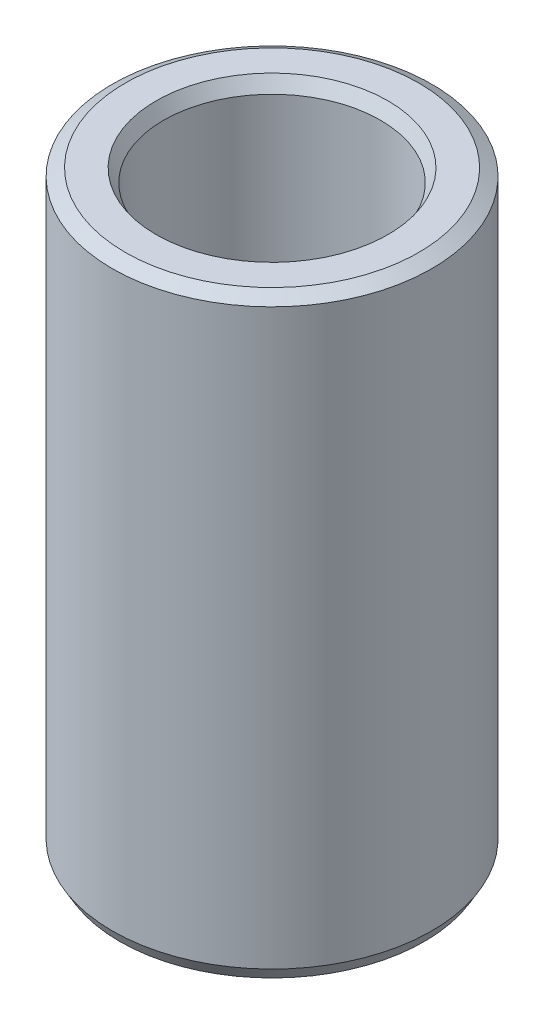
ISO-10303-21;
HEADER;
FILE_DESCRIPTION(('STEP AP214'),'2;1');
FILE_NAME('part.step','',(''),(''),'','','');
FILE_SCHEMA(('AUTOMOTIVE_DESIGN { 1 0 10303 214 1 1 1 1 }'));
ENDSEC;
DATA;
#1=APPLICATION_CONTEXT('core data for automotive mechanical design processes');
#2=APPLICATION_PROTOCOL_DEFINITION('international standard','automotive_design',2000,#1);
#3=PRODUCT_CONTEXT('',#1,'mechanical');
#4=PRODUCT('Part','Part','',(#3));
#5=PRODUCT_RELATED_PRODUCT_CATEGORY('part','',(#4));
#6=PRODUCT_DEFINITION_FORMATION('','',#4);
#7=PRODUCT_DEFINITION_CONTEXT('part definition',#1,'design');
#8=PRODUCT_DEFINITION('design','',#6,#7);
#9=PRODUCT_DEFINITION_SHAPE('','',#8);
#10=(LENGTH_UNIT() NAMED_UNIT(*) SI_UNIT(.MILLI.,.METRE.));
#11=(NAMED_UNIT(*) PLANE_ANGLE_UNIT() SI_UNIT($,.RADIAN.));
#12=(NAMED_UNIT(*) SI_UNIT($,.STERADIAN.) SOLID_ANGLE_UNIT());
#13=UNCERTAINTY_MEASURE_WITH_UNIT(LENGTH_MEASURE(1.E-05),#10,'distance_accuracy_value','');
#14=(GEOMETRIC_REPRESENTATION_CONTEXT(3) GLOBAL_UNCERTAINTY_ASSIGNED_CONTEXT((#13)) GLOBAL_UNIT_ASSIGNED_CONTEXT((#10,
#11,#12)) REPRESENTATION_CONTEXT('',''));
#15=CARTESIAN_POINT('',(0.,0.,0.));
#16=DIRECTION('',(0.,0.,1.));
#17=DIRECTION('',(1.,0.,0.));
#18=AXIS2_PLACEMENT_3D('',#15,#16,#17);
#19=CARTESIAN_POINT('',(0.,223.06524936838,0.));
#20=DIRECTION('',(0.,-1.,0.));
#21=DIRECTION('',(0.,0.,-1.));
#22=AXIS2_PLACEMENT_3D('',#19,#20,#21);
#23=CYLINDRICAL_SURFACE('',#22,60.);
#24=CARTESIAN_POINT('',(0.,4.89102123911372,0.));
#25=DIRECTION('',(0.,1.,0.));
#26=DIRECTION('',(0.,0.,1.));
#27=AXIS2_PLACEMENT_3D('',#24,#25,#26);
#28=CIRCLE('',#27,60.);
#29=CARTESIAN_POINT('',(0.,4.89102123911372,60.));
#30=VERTEX_POINT('',#29);
#31=EDGE_CURVE('E10',#30,#30,#28,.T.);
#32=ORIENTED_EDGE('',*,*,#31,.T.);
#33=EDGE_LOOP('',(#32));
#34=FACE_BOUND('',#33,.T.);
#35=CARTESIAN_POINT('',(0.,220.241416939365,0.));
#36=DIRECTION('',(0.,1.,0.));
#37=DIRECTION('',(0.,0.,1.));
#38=AXIS2_PLACEMENT_3D('',#35,#36,#37);
#39=CIRCLE('',#38,60.);
#40=CARTESIAN_POINT('',(0.,220.241416939365,60.));
#41=VERTEX_POINT('',#40);
#42=EDGE_CURVE('E50',#41,#41,#39,.F.);
#43=ORIENTED_EDGE('',*,*,#42,.T.);
#44=EDGE_LOOP('',(#43));
#45=FACE_BOUND('',#44,.T.);
#46=ADVANCED_FACE('F39',(#34,#45),#23,.T.);
#47=CARTESIAN_POINT('',(0.,223.06524936838,0.));
#48=DIRECTION('',(0.,1.,0.));
#49=DIRECTION('',(0.,0.,1.));
#50=AXIS2_PLACEMENT_3D('',#47,#48,#49);
#51=PLANE('',#50);
#52=CARTESIAN_POINT('',(0.,223.06524936838,0.));
#53=DIRECTION('',(0.,1.,0.));
#54=DIRECTION('',(0.,0.,1.));
#55=AXIS2_PLACEMENT_3D('',#52,#53,#54);
#56=CIRCLE('',#55,43.5349068001525);
#57=CARTESIAN_POINT('',(0.,223.065249368379,43.5349068001524));
#58=VERTEX_POINT('',#57);
#59=EDGE_CURVE('E58',#58,#58,#56,.F.);
#60=ORIENTED_EDGE('',*,*,#59,.T.);
#61=EDGE_LOOP('',(#60));
#62=FACE_BOUND('',#61,.T.);
#63=CARTESIAN_POINT('',(0.,223.06524936838,0.));
#64=DIRECTION('',(0.,1.,0.));
#65=DIRECTION('',(0.,0.,1.));
#66=AXIS2_PLACEMENT_3D('',#63,#64,#65);
#67=CIRCLE('',#66,55.1089787608863);
#68=CARTESIAN_POINT('',(0.,223.06524936838,55.1089787608863));
#69=VERTEX_POINT('',#68);
#70=EDGE_CURVE('E61',#69,#69,#67,.T.);
#71=ORIENTED_EDGE('',*,*,#70,.T.);
#72=EDGE_LOOP('',(#71));
#73=FACE_BOUND('',#72,.T.);
#74=ADVANCED_FACE('F88',(#62,#73),#51,.T.);
#75=CARTESIAN_POINT('',(0.,0.,0.));
#76=DIRECTION('',(0.,1.,0.));
#77=DIRECTION('',(0.,0.,1.));
#78=AXIS2_PLACEMENT_3D('',#75,#76,#77);
#79=PLANE('',#78);
#80=CARTESIAN_POINT('',(0.,0.,0.));
#81=DIRECTION('',(0.,1.,0.));
#82=DIRECTION('',(0.,0.,1.));
#83=AXIS2_PLACEMENT_3D('',#80,#81,#82);
#84=CIRCLE('',#83,45.6020956102517);
#85=CARTESIAN_POINT('',(0.,0.,45.6020956102517));
#86=VERTEX_POINT('',#85);
#87=EDGE_CURVE('E51',#86,#86,#84,.T.);
#88=ORIENTED_EDGE('',*,*,#87,.T.);
#89=EDGE_LOOP('',(#88));
#90=FACE_BOUND('',#89,.T.);
#91=CARTESIAN_POINT('',(0.,0.,0.));
#92=DIRECTION('',(0.,1.,0.));
#93=DIRECTION('',(0.,0.,1.));
#94=AXIS2_PLACEMENT_3D('',#91,#92,#93);
#95=CIRCLE('',#94,57.1761675709855);
#96=CARTESIAN_POINT('',(0.,0.,57.1761675709855));
#97=VERTEX_POINT('',#96);
#98=EDGE_CURVE('E54',#97,#97,#95,.F.);
#99=ORIENTED_EDGE('',*,*,#98,.T.);
#100=EDGE_LOOP('',(#99));
#101=FACE_BOUND('',#100,.T.);
#102=ADVANCED_FACE('F83',(#90,#101),#79,.F.);
#103=CARTESIAN_POINT('',(0.,223.06524936838,0.));
#104=DIRECTION('',(0.,-1.,0.));
#105=DIRECTION('',(0.,0.,-1.));
#106=AXIS2_PLACEMENT_3D('',#103,#104,#105);
#107=CYLINDRICAL_SURFACE('',#106,40.711074371138);
#108=CARTESIAN_POINT('',(0.,218.174228129266,0.));
#109=DIRECTION('',(0.,1.,0.));
#110=DIRECTION('',(0.,0.,1.));
#111=AXIS2_PLACEMENT_3D('',#108,#109,#110);
#112=CIRCLE('',#111,40.711074371138);
#113=CARTESIAN_POINT('',(0.,218.174228129266,40.711074371138));
#114=VERTEX_POINT('',#113);
#115=EDGE_CURVE('E67',#114,#114,#112,.T.);
#116=ORIENTED_EDGE('',*,*,#115,.T.);
#117=EDGE_LOOP('',(#116));
#118=FACE_BOUND('',#117,.T.);
#119=CARTESIAN_POINT('',(0.,2.82383242901449,0.));
#120=DIRECTION('',(0.,1.,0.));
#121=DIRECTION('',(0.,0.,1.));
#122=AXIS2_PLACEMENT_3D('',#119,#120,#121);
#123=CIRCLE('',#122,40.711074371138);
#124=CARTESIAN_POINT('',(0.,2.82383242901449,40.711074371138));
#125=VERTEX_POINT('',#124);
#126=EDGE_CURVE('E69',#125,#125,#123,.F.);
#127=ORIENTED_EDGE('',*,*,#126,.T.);
#128=EDGE_LOOP('',(#127));
#129=FACE_BOUND('',#128,.T.);
#130=ADVANCED_FACE('F71',(#118,#129),#107,.F.);
#131=CARTESIAN_POINT('',(0.,218.174228129266,0.));
#132=DIRECTION('',(0.,1.,0.));
#133=DIRECTION('',(0.,0.,1.));
#134=AXIS2_PLACEMENT_3D('',#131,#132,#133);
#135=CONICAL_SURFACE('',#134,40.711074371138,0.523598775598299);
#136=CARTESIAN_POINT('',(0.,223.065249368379,43.5349068001524));
#137=CARTESIAN_POINT('',(0.,223.014301230472,43.5054918790169));
#138=CARTESIAN_POINT('',(0.,222.963353092565,43.4760769578813));
#139=CARTESIAN_POINT('',(0.,222.86145681675,43.4172471156102));
#140=CARTESIAN_POINT('',(0.,222.810508678842,43.3878321944746));
#141=CARTESIAN_POINT('',(0.,222.708612403027,43.3290023522035));
#142=CARTESIAN_POINT('',(0.,222.65766426512,43.2995874310679));
#143=CARTESIAN_POINT('',(0.,222.555767989305,43.2407575887968));
#144=CARTESIAN_POINT('',(0.,222.504819851398,43.2113426676612));
#145=CARTESIAN_POINT('',(0.,222.402923575583,43.1525128253901));
#146=CARTESIAN_POINT('',(0.,222.351975437675,43.1230979042545));
#147=CARTESIAN_POINT('',(0.,222.250079161861,43.0642680619834));
#148=CARTESIAN_POINT('',(0.,222.199131023953,43.0348531408478));
#149=CARTESIAN_POINT('',(0.,222.097234748138,42.9760232985767));
#150=CARTESIAN_POINT('',(0.,222.046286610231,42.9466083774411));
#151=CARTESIAN_POINT('',(0.,221.944390334416,42.88777853517));
#152=CARTESIAN_POINT('',(0.,221.893442196509,42.8583636140344));
#153=CARTESIAN_POINT('',(0.,221.791545920694,42.7995337717633));
#154=CARTESIAN_POINT('',(0.,221.740597782786,42.7701188506277));
#155=CARTESIAN_POINT('',(0.,221.638701506971,42.7112890083566));
#156=CARTESIAN_POINT('',(0.,221.587753369064,42.681874087221));
#157=CARTESIAN_POINT('',(0.,221.485857093249,42.6230442449499));
#158=CARTESIAN_POINT('',(0.,221.434908955342,42.5936293238143));
#159=CARTESIAN_POINT('',(0.,221.333012679527,42.5347994815432));
#160=CARTESIAN_POINT('',(0.,221.282064541619,42.5053845604076));
#161=CARTESIAN_POINT('',(0.,221.180168265804,42.4465547181365));
#162=CARTESIAN_POINT('',(0.,221.129220127897,42.4171397970009));
#163=CARTESIAN_POINT('',(0.,221.027323852082,42.3583099547298));
#164=CARTESIAN_POINT('',(0.,220.976375714175,42.3288950335942));
#165=CARTESIAN_POINT('',(0.,220.87447943836,42.2700651913231));
#166=CARTESIAN_POINT('',(0.,220.823531300452,42.2406502701875));
#167=CARTESIAN_POINT('',(0.,220.721635024638,42.1818204279164));
#168=CARTESIAN_POINT('',(0.,220.67068688673,42.1524055067808));
#169=CARTESIAN_POINT('',(0.,220.568790610915,42.0935756645097));
#170=CARTESIAN_POINT('',(0.,220.517842473008,42.0641607433741));
#171=CARTESIAN_POINT('',(0.,220.415946197193,42.005330901103));
#172=CARTESIAN_POINT('',(0.,220.364998059286,41.9759159799674));
#173=CARTESIAN_POINT('',(0.,220.263101783471,41.9170861376963));
#174=CARTESIAN_POINT('',(0.,220.212153645563,41.8876712165607));
#175=CARTESIAN_POINT('',(0.,220.110257369748,41.8288413742896));
#176=CARTESIAN_POINT('',(0.,220.059309231841,41.799426453154));
#177=CARTESIAN_POINT('',(0.,219.957412956026,41.7405966108829));
#178=CARTESIAN_POINT('',(0.,219.906464818119,41.7111816897473));
#179=CARTESIAN_POINT('',(0.,219.804568542304,41.6523518474762));
#180=CARTESIAN_POINT('',(0.,219.753620404396,41.6229369263406));
#181=CARTESIAN_POINT('',(0.,219.651724128581,41.5641070840695));
#182=CARTESIAN_POINT('',(0.,219.600775990674,41.5346921629339));
#183=CARTESIAN_POINT('',(0.,219.498879714859,41.4758623206628));
#184=CARTESIAN_POINT('',(0.,219.447931576952,41.4464473995272));
#185=CARTESIAN_POINT('',(0.,219.346035301137,41.3876175572561));
#186=CARTESIAN_POINT('',(0.,219.295087163229,41.3582026361205));
#187=CARTESIAN_POINT('',(0.,219.193190887415,41.2993727938494));
#188=CARTESIAN_POINT('',(0.,219.142242749507,41.2699578727138));
#189=CARTESIAN_POINT('',(0.,219.040346473692,41.2111280304427));
#190=CARTESIAN_POINT('',(0.,218.989398335785,41.1817131093071));
#191=CARTESIAN_POINT('',(0.,218.88750205997,41.122883267036));
#192=CARTESIAN_POINT('',(0.,218.836553922063,41.0934683459004));
#193=CARTESIAN_POINT('',(0.,218.734657646248,41.0346385036293));
#194=CARTESIAN_POINT('',(0.,218.68370950834,41.0052235824937));
#195=CARTESIAN_POINT('',(0.,218.581813232525,40.9463937402226));
#196=CARTESIAN_POINT('',(0.,218.530865094618,40.916978819087));
#197=CARTESIAN_POINT('',(0.,218.428968818803,40.8581489768159));
#198=CARTESIAN_POINT('',(0.,218.378020680896,40.8287340556803));
#199=CARTESIAN_POINT('',(0.,218.276124405081,40.7699042134092));
#200=CARTESIAN_POINT('',(0.,218.225176267173,40.7404892922736));
#201=CARTESIAN_POINT('',(0.,218.174228129266,40.711074371138));
#202=B_SPLINE_CURVE_WITH_KNOTS('',3,(#136,#137,#138,#139,#140,#141,#142,#143,#144,#145,#146,
#147,#148,#149,#150,#151,#152,#153,#154,#155,#156,#157,#158,#159,#160,#161,#162,#163,#164,#165,
#166,#167,#168,#169,#170,#171,#172,#173,#174,#175,#176,#177,#178,#179,#180,#181,#182,#183,#184,
#185,#186,#187,#188,#189,#190,#191,#192,#193,#194,#195,#196,#197,#198,#199,#200,#201),
.UNSPECIFIED.,.F.,.F.,(4,2,2,2,2,2,2,2,2,2,2,2,2,2,2,2,2,2,2,2,2,2,2,2,2,2,2,2,2,2,2,2,4),(0.,
0.176489526813394,0.352979053626787,0.529468580440181,0.705958107253598,0.882447634066995,
1.05893716088039,1.23542668769381,1.4119162145072,1.58840574132059,1.76489526813401,
1.94138479494741,2.1178743217608,2.29436384857422,2.47085337538761,2.647342902201,
2.82383242901442,3.00032195582781,3.17681148264121,3.3533010094546,3.52979053626802,
3.70628006308141,3.88276958989481,4.05925911670823,4.23574864352162,4.41223817033501,
4.58872769714843,4.76521722396182,4.94170675077522,5.11819627758864,5.29468580440203,
5.47117533121542,5.64766485802882),.UNSPECIFIED.);
#203=EDGE_CURVE('BSEAM77',#58,#114,#202,.T.);
#204=ORIENTED_EDGE('',*,*,#59,.F.);
#205=ORIENTED_EDGE('',*,*,#115,.F.);
#206=ORIENTED_EDGE('',*,*,#203,.T.);
#207=ORIENTED_EDGE('',*,*,#203,.F.);
#208=EDGE_LOOP('',(#204,#206,#205,#207));
#209=FACE_BOUND('',#208,.T.);
#210=ADVANCED_FACE('F77',(#209),#135,.F.);
#211=CARTESIAN_POINT('',(0.,0.,0.));
#212=DIRECTION('',(0.,-1.,0.));
#213=DIRECTION('',(0.,0.,-1.));
#214=AXIS2_PLACEMENT_3D('',#211,#212,#213);
#215=CONICAL_SURFACE('',#214,45.6020956102517,1.0471975511966);
#216=ORIENTED_EDGE('',*,*,#126,.F.);
#217=EDGE_LOOP('',(#216));
#218=FACE_BOUND('',#217,.T.);
#219=ORIENTED_EDGE('',*,*,#87,.F.);
#220=EDGE_LOOP('',(#219));
#221=FACE_BOUND('',#220,.T.);
#222=ADVANCED_FACE('F73',(#218,#221),#215,.F.);
#223=CARTESIAN_POINT('',(0.,4.89102123911372,0.));
#224=DIRECTION('',(0.,1.,0.));
#225=DIRECTION('',(0.,0.,1.));
#226=AXIS2_PLACEMENT_3D('',#223,#224,#225);
#227=CONICAL_SURFACE('',#226,60.,0.523598775598306);
#228=ORIENTED_EDGE('',*,*,#98,.F.);
#229=EDGE_LOOP('',(#228));
#230=FACE_BOUND('',#229,.T.);
#231=ORIENTED_EDGE('',*,*,#31,.F.);
#232=EDGE_LOOP('',(#231));
#233=FACE_BOUND('',#232,.T.);
#234=ADVANCED_FACE('F76',(#230,#233),#227,.T.);
#235=CARTESIAN_POINT('',(0.,223.06524936838,0.));
#236=DIRECTION('',(0.,-1.,0.));
#237=DIRECTION('',(0.,0.,-1.));
#238=AXIS2_PLACEMENT_3D('',#235,#236,#237);
#239=CONICAL_SURFACE('',#238,55.1089787608863,1.04719755119659);
#240=ORIENTED_EDGE('',*,*,#42,.F.);
#241=EDGE_LOOP('',(#240));
#242=FACE_BOUND('',#241,.T.);
#243=ORIENTED_EDGE('',*,*,#70,.F.);
#244=EDGE_LOOP('',(#243));
#245=FACE_BOUND('',#244,.T.);
#246=ADVANCED_FACE('F45',(#242,#245),#239,.T.);
#247=CLOSED_SHELL('',(#46,#74,#102,#130,#210,#222,#234,#246));
#248=MANIFOLD_SOLID_BREP('B2',#247);
#249=ADVANCED_BREP_SHAPE_REPRESENTATION('',(#18,#248),#14);
#250=SHAPE_DEFINITION_REPRESENTATION(#9,#249);
ENDSEC;
END-ISO-10303-21;
